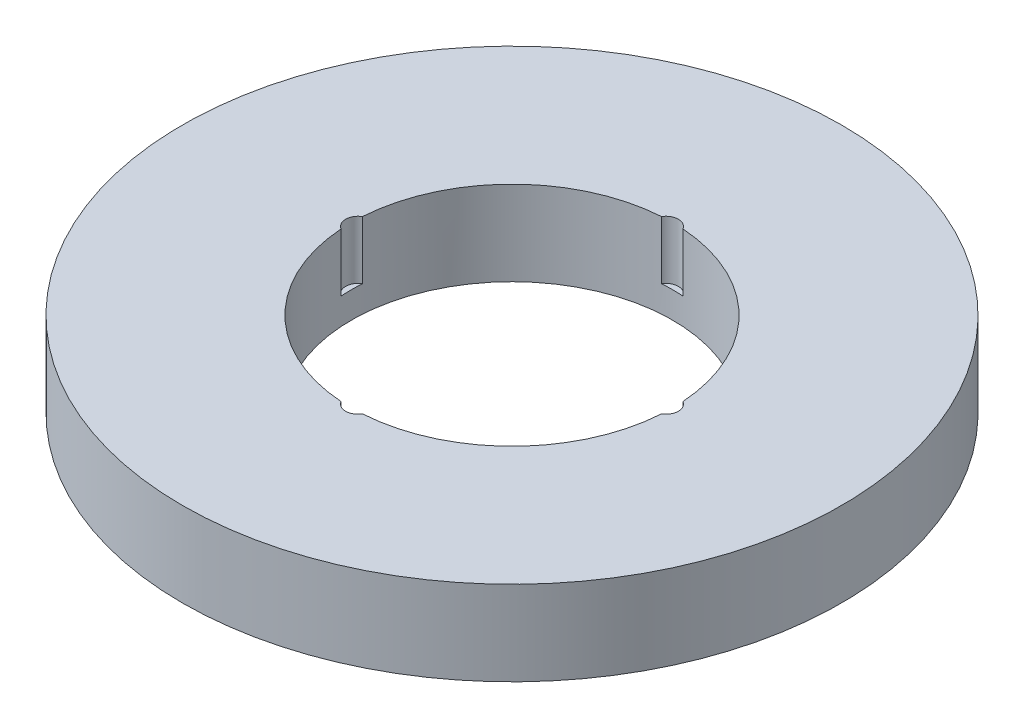
ISO-10303-21;
HEADER;
FILE_DESCRIPTION(('STEP AP214'),'2;1');
FILE_NAME('part.step','',(''),(''),'','','');
FILE_SCHEMA(('AUTOMOTIVE_DESIGN { 1 0 10303 214 1 1 1 1 }'));
ENDSEC;
DATA;
#1=APPLICATION_CONTEXT('core data for automotive mechanical design processes');
#2=APPLICATION_PROTOCOL_DEFINITION('international standard','automotive_design',2000,#1);
#3=PRODUCT_CONTEXT('',#1,'mechanical');
#4=PRODUCT('Part','Part','',(#3));
#5=PRODUCT_RELATED_PRODUCT_CATEGORY('part','',(#4));
#6=PRODUCT_DEFINITION_FORMATION('','',#4);
#7=PRODUCT_DEFINITION_CONTEXT('part definition',#1,'design');
#8=PRODUCT_DEFINITION('design','',#6,#7);
#9=PRODUCT_DEFINITION_SHAPE('','',#8);
#10=(LENGTH_UNIT() NAMED_UNIT(*) SI_UNIT(.MILLI.,.METRE.));
#11=(NAMED_UNIT(*) PLANE_ANGLE_UNIT() SI_UNIT($,.RADIAN.));
#12=(NAMED_UNIT(*) SI_UNIT($,.STERADIAN.) SOLID_ANGLE_UNIT());
#13=UNCERTAINTY_MEASURE_WITH_UNIT(LENGTH_MEASURE(1.E-05),#10,'distance_accuracy_value','');
#14=(GEOMETRIC_REPRESENTATION_CONTEXT(3) GLOBAL_UNCERTAINTY_ASSIGNED_CONTEXT((#13)) GLOBAL_UNIT_ASSIGNED_CONTEXT((#10,
#11,#12)) REPRESENTATION_CONTEXT('',''));
#15=CARTESIAN_POINT('',(0.,0.,0.));
#16=DIRECTION('',(0.,0.,1.));
#17=DIRECTION('',(1.,0.,0.));
#18=AXIS2_PLACEMENT_3D('',#15,#16,#17);
#19=CARTESIAN_POINT('',(0.,25.,0.));
#20=DIRECTION('',(0.,-1.,0.));
#21=DIRECTION('',(0.,0.,-1.));
#22=AXIS2_PLACEMENT_3D('',#19,#20,#21);
#23=CYLINDRICAL_SURFACE('',#22,97.5);
#24=CARTESIAN_POINT('',(0.,25.,0.));
#25=DIRECTION('',(0.,1.,0.));
#26=DIRECTION('',(0.,0.,1.));
#27=AXIS2_PLACEMENT_3D('',#24,#25,#26);
#28=CIRCLE('',#27,97.5);
#29=CARTESIAN_POINT('',(0.,25.,97.5));
#30=VERTEX_POINT('',#29);
#31=EDGE_CURVE('E148',#30,#30,#28,.T.);
#32=ORIENTED_EDGE('',*,*,#31,.F.);
#33=EDGE_LOOP('',(#32));
#34=FACE_BOUND('',#33,.T.);
#35=CARTESIAN_POINT('',(0.,0.,0.));
#36=DIRECTION('',(0.,1.,0.));
#37=DIRECTION('',(0.,0.,1.));
#38=AXIS2_PLACEMENT_3D('',#35,#36,#37);
#39=CIRCLE('',#38,97.5);
#40=CARTESIAN_POINT('',(0.,0.,97.5));
#41=VERTEX_POINT('',#40);
#42=EDGE_CURVE('E139',#41,#41,#39,.T.);
#43=ORIENTED_EDGE('',*,*,#42,.T.);
#44=EDGE_LOOP('',(#43));
#45=FACE_BOUND('',#44,.T.);
#46=ADVANCED_FACE('F39',(#34,#45),#23,.T.);
#47=CARTESIAN_POINT('',(0.,25.,0.));
#48=DIRECTION('',(0.,1.,0.));
#49=DIRECTION('',(0.,0.,1.));
#50=AXIS2_PLACEMENT_3D('',#47,#48,#49);
#51=PLANE('',#50);
#52=CARTESIAN_POINT('',(1.58996777581325E-13,25.,45.5384870062077));
#53=DIRECTION('',(0.,1.,0.));
#54=DIRECTION('',(1.,0.,0.));
#55=AXIS2_PLACEMENT_3D('',#52,#53,#54);
#56=CIRCLE('',#55,3.67099523526004);
#57=CARTESIAN_POINT('',(-3.16737099135007,25.,47.3942798342074));
#58=VERTEX_POINT('',#57);
#59=CARTESIAN_POINT('',(3.1673709913504,25.,47.3942798342073));
#60=VERTEX_POINT('',#59);
#61=EDGE_CURVE('E175',#58,#60,#56,.T.);
#62=ORIENTED_EDGE('',*,*,#61,.F.);
#63=CARTESIAN_POINT('',(0.,25.,0.));
#64=DIRECTION('',(0.,1.,0.));
#65=DIRECTION('',(0.,0.,1.));
#66=AXIS2_PLACEMENT_3D('',#63,#64,#65);
#67=CIRCLE('',#66,47.5);
#68=CARTESIAN_POINT('',(-47.3942798342074,25.,3.16737099135023));
#69=VERTEX_POINT('',#68);
#70=EDGE_CURVE('E134',#69,#58,#67,.T.);
#71=ORIENTED_EDGE('',*,*,#70,.F.);
#72=CARTESIAN_POINT('',(-45.5384870062077,25.,0.));
#73=DIRECTION('',(0.,1.,0.));
#74=DIRECTION('',(0.,0.,1.));
#75=AXIS2_PLACEMENT_3D('',#72,#73,#74);
#76=CIRCLE('',#75,3.67099523526004);
#77=CARTESIAN_POINT('',(-47.3942798342074,25.,-3.16737099135023));
#78=VERTEX_POINT('',#77);
#79=EDGE_CURVE('E143',#78,#69,#76,.T.);
#80=ORIENTED_EDGE('',*,*,#79,.F.);
#81=CARTESIAN_POINT('',(-3.16737099135073,25.,-47.3942798342073));
#82=VERTEX_POINT('',#81);
#83=EDGE_CURVE('E123',#82,#78,#67,.T.);
#84=ORIENTED_EDGE('',*,*,#83,.F.);
#85=CARTESIAN_POINT('',(-4.76990332743974E-13,25.,-45.5384870062077));
#86=DIRECTION('',(0.,1.,0.));
#87=DIRECTION('',(-1.,0.,0.));
#88=AXIS2_PLACEMENT_3D('',#85,#86,#87);
#89=CIRCLE('',#88,3.67099523526004);
#90=CARTESIAN_POINT('',(3.16737099134974,25.,-47.3942798342074));
#91=VERTEX_POINT('',#90);
#92=EDGE_CURVE('E106',#91,#82,#89,.T.);
#93=ORIENTED_EDGE('',*,*,#92,.F.);
#94=CARTESIAN_POINT('',(47.3942798342074,25.,-3.16737099135023));
#95=VERTEX_POINT('',#94);
#96=EDGE_CURVE('E125',#95,#91,#67,.T.);
#97=ORIENTED_EDGE('',*,*,#96,.F.);
#98=CARTESIAN_POINT('',(45.5384870062077,25.,0.));
#99=DIRECTION('',(0.,1.,0.));
#100=DIRECTION('',(0.,0.,-1.));
#101=AXIS2_PLACEMENT_3D('',#98,#99,#100);
#102=CIRCLE('',#101,3.67099523526004);
#103=CARTESIAN_POINT('',(47.3942798342074,25.,3.16737099135023));
#104=VERTEX_POINT('',#103);
#105=EDGE_CURVE('E286',#104,#95,#102,.T.);
#106=ORIENTED_EDGE('',*,*,#105,.F.);
#107=EDGE_CURVE('E135',#60,#104,#67,.T.);
#108=ORIENTED_EDGE('',*,*,#107,.F.);
#109=EDGE_LOOP('',(#62,#71,#80,#84,#93,#97,#106,#108));
#110=FACE_BOUND('',#109,.T.);
#111=ORIENTED_EDGE('',*,*,#31,.T.);
#112=EDGE_LOOP('',(#111));
#113=FACE_BOUND('',#112,.T.);
#114=ADVANCED_FACE('F118',(#110,#113),#51,.T.);
#115=CARTESIAN_POINT('',(0.,0.,0.));
#116=DIRECTION('',(0.,1.,0.));
#117=DIRECTION('',(0.,0.,1.));
#118=AXIS2_PLACEMENT_3D('',#115,#116,#117);
#119=PLANE('',#118);
#120=CARTESIAN_POINT('',(0.,0.,0.));
#121=DIRECTION('',(0.,1.,0.));
#122=DIRECTION('',(0.,0.,1.));
#123=AXIS2_PLACEMENT_3D('',#120,#121,#122);
#124=CIRCLE('',#123,47.5);
#125=CARTESIAN_POINT('',(0.,0.,47.5));
#126=VERTEX_POINT('',#125);
#127=EDGE_CURVE('E136',#126,#126,#124,.T.);
#128=ORIENTED_EDGE('',*,*,#127,.T.);
#129=EDGE_LOOP('',(#128));
#130=FACE_BOUND('',#129,.T.);
#131=ORIENTED_EDGE('',*,*,#42,.F.);
#132=EDGE_LOOP('',(#131));
#133=FACE_BOUND('',#132,.T.);
#134=ADVANCED_FACE('F187',(#130,#133),#119,.F.);
#135=CARTESIAN_POINT('',(0.,25.,0.));
#136=DIRECTION('',(0.,-1.,0.));
#137=DIRECTION('',(0.,0.,-1.));
#138=AXIS2_PLACEMENT_3D('',#135,#136,#137);
#139=CYLINDRICAL_SURFACE('',#138,47.5);
#140=DIRECTION('',(0.,1.,0.));
#141=VECTOR('',#140,1.);
#142=CARTESIAN_POINT('',(-3.16737099135008,16.3977777487847,47.3942798342073));
#143=LINE('',#142,#141);
#144=CARTESIAN_POINT('',(-3.16737099135007,7.79555549756932,47.3942798342074));
#145=VERTEX_POINT('',#144);
#146=EDGE_CURVE('E11',#145,#58,#143,.T.);
#147=ORIENTED_EDGE('',*,*,#146,.F.);
#148=CARTESIAN_POINT('',(0.,7.79555549756932,0.));
#149=DIRECTION('',(0.,1.,0.));
#150=DIRECTION('',(0.,0.,1.));
#151=AXIS2_PLACEMENT_3D('',#148,#149,#150);
#152=CIRCLE('',#151,47.5);
#153=CARTESIAN_POINT('',(3.1673709913504,7.79555549756932,47.3942798342073));
#154=VERTEX_POINT('',#153);
#155=EDGE_CURVE('E170',#145,#154,#152,.T.);
#156=ORIENTED_EDGE('',*,*,#155,.T.);
#157=DIRECTION('',(0.,1.,0.));
#158=VECTOR('',#157,1.);
#159=CARTESIAN_POINT('',(3.16737099135041,16.3977777487847,47.3942798342073));
#160=LINE('',#159,#158);
#161=EDGE_CURVE('E46',#60,#154,#160,.F.);
#162=ORIENTED_EDGE('',*,*,#161,.F.);
#163=ORIENTED_EDGE('',*,*,#107,.T.);
#164=DIRECTION('',(0.,1.,0.));
#165=VECTOR('',#164,1.);
#166=CARTESIAN_POINT('',(47.3942798342073,16.3977777487847,3.16737099135024));
#167=LINE('',#166,#165);
#168=CARTESIAN_POINT('',(47.3942798342074,7.79555549756932,3.16737099135023));
#169=VERTEX_POINT('',#168);
#170=EDGE_CURVE('E164',#169,#104,#167,.T.);
#171=ORIENTED_EDGE('',*,*,#170,.F.);
#172=CARTESIAN_POINT('',(0.,7.79555549756932,0.));
#173=DIRECTION('',(0.,1.,0.));
#174=DIRECTION('',(0.,0.,1.));
#175=AXIS2_PLACEMENT_3D('',#172,#173,#174);
#176=CIRCLE('',#175,47.5);
#177=CARTESIAN_POINT('',(47.3942798342074,7.79555549756932,-3.16737099135023));
#178=VERTEX_POINT('',#177);
#179=EDGE_CURVE('E115',#169,#178,#176,.T.);
#180=ORIENTED_EDGE('',*,*,#179,.T.);
#181=DIRECTION('',(0.,1.,0.));
#182=VECTOR('',#181,1.);
#183=CARTESIAN_POINT('',(47.3942798342073,16.3977777487847,-3.16737099135024));
#184=LINE('',#183,#182);
#185=EDGE_CURVE('E131',#95,#178,#184,.F.);
#186=ORIENTED_EDGE('',*,*,#185,.F.);
#187=ORIENTED_EDGE('',*,*,#96,.T.);
#188=DIRECTION('',(0.,1.,0.));
#189=VECTOR('',#188,1.);
#190=CARTESIAN_POINT('',(3.16737099134975,16.3977777487847,-47.3942798342074));
#191=LINE('',#190,#189);
#192=CARTESIAN_POINT('',(3.16737099134974,7.79555549756932,-47.3942798342074));
#193=VERTEX_POINT('',#192);
#194=EDGE_CURVE('E105',#193,#91,#191,.T.);
#195=ORIENTED_EDGE('',*,*,#194,.F.);
#196=CARTESIAN_POINT('',(0.,7.79555549756932,0.));
#197=DIRECTION('',(0.,1.,0.));
#198=DIRECTION('',(0.,0.,1.));
#199=AXIS2_PLACEMENT_3D('',#196,#197,#198);
#200=CIRCLE('',#199,47.5);
#201=CARTESIAN_POINT('',(-3.16737099135073,7.79555549756932,-47.3942798342073));
#202=VERTEX_POINT('',#201);
#203=EDGE_CURVE('E159',#193,#202,#200,.T.);
#204=ORIENTED_EDGE('',*,*,#203,.T.);
#205=DIRECTION('',(0.,1.,0.));
#206=VECTOR('',#205,1.);
#207=CARTESIAN_POINT('',(-3.16737099135074,16.3977777487847,-47.3942798342073));
#208=LINE('',#207,#206);
#209=EDGE_CURVE('E114',#82,#202,#208,.F.);
#210=ORIENTED_EDGE('',*,*,#209,.F.);
#211=ORIENTED_EDGE('',*,*,#83,.T.);
#212=DIRECTION('',(0.,1.,0.));
#213=VECTOR('',#212,1.);
#214=CARTESIAN_POINT('',(-47.3942798342073,16.3977777487847,-3.16737099135024));
#215=LINE('',#214,#213);
#216=CARTESIAN_POINT('',(-47.3942798342074,7.79555549756932,-3.16737099135023));
#217=VERTEX_POINT('',#216);
#218=EDGE_CURVE('E160',#217,#78,#215,.T.);
#219=ORIENTED_EDGE('',*,*,#218,.F.);
#220=CARTESIAN_POINT('',(0.,7.79555549756932,0.));
#221=DIRECTION('',(0.,1.,0.));
#222=DIRECTION('',(0.,0.,1.));
#223=AXIS2_PLACEMENT_3D('',#220,#221,#222);
#224=CIRCLE('',#223,47.5);
#225=CARTESIAN_POINT('',(-47.3942798342074,7.79555549756932,3.16737099135023));
#226=VERTEX_POINT('',#225);
#227=EDGE_CURVE('E149',#217,#226,#224,.T.);
#228=ORIENTED_EDGE('',*,*,#227,.T.);
#229=DIRECTION('',(0.,1.,0.));
#230=VECTOR('',#229,1.);
#231=CARTESIAN_POINT('',(-47.3942798342073,16.3977777487847,3.16737099135024));
#232=LINE('',#231,#230);
#233=EDGE_CURVE('E152',#69,#226,#232,.F.);
#234=ORIENTED_EDGE('',*,*,#233,.F.);
#235=ORIENTED_EDGE('',*,*,#70,.T.);
#236=EDGE_LOOP('',(#147,#156,#162,#163,#171,#180,#186,#187,#195,#204,#210,#211,#219,#228,#234,#235));
#237=FACE_BOUND('',#236,.T.);
#238=ORIENTED_EDGE('',*,*,#127,.F.);
#239=EDGE_LOOP('',(#238));
#240=FACE_BOUND('',#239,.T.);
#241=ADVANCED_FACE('F126',(#237,#240),#139,.F.);
#242=CARTESIAN_POINT('',(-45.5384870062077,7.79555549756932,0.));
#243=DIRECTION('',(0.,1.,0.));
#244=DIRECTION('',(0.,0.,1.));
#245=AXIS2_PLACEMENT_3D('',#242,#243,#244);
#246=CYLINDRICAL_SURFACE('',#245,3.67099523526004);
#247=ORIENTED_EDGE('',*,*,#218,.T.);
#248=ORIENTED_EDGE('',*,*,#79,.T.);
#249=ORIENTED_EDGE('',*,*,#233,.T.);
#250=CARTESIAN_POINT('',(-45.5384870062077,7.79555549756932,0.));
#251=DIRECTION('',(0.,1.,0.));
#252=DIRECTION('',(0.,0.,1.));
#253=AXIS2_PLACEMENT_3D('',#250,#251,#252);
#254=CIRCLE('',#253,3.67099523526004);
#255=EDGE_CURVE('E144',#217,#226,#254,.T.);
#256=ORIENTED_EDGE('',*,*,#255,.F.);
#257=EDGE_LOOP('',(#247,#248,#249,#256));
#258=FACE_BOUND('',#257,.T.);
#259=ADVANCED_FACE('F200',(#258),#246,.F.);
#260=CARTESIAN_POINT('',(-45.5384870062077,7.79555549756932,0.));
#261=DIRECTION('',(0.,1.,0.));
#262=DIRECTION('',(0.,0.,1.));
#263=AXIS2_PLACEMENT_3D('',#260,#261,#262);
#264=PLANE('',#263);
#265=ORIENTED_EDGE('',*,*,#255,.T.);
#266=ORIENTED_EDGE('',*,*,#227,.F.);
#267=EDGE_LOOP('',(#265,#266));
#268=FACE_BOUND('',#267,.T.);
#269=ADVANCED_FACE('F201',(#268),#264,.T.);
#270=CARTESIAN_POINT('',(-4.76990332743974E-13,7.79555549756932,-45.5384870062077));
#271=DIRECTION('',(0.,1.,0.));
#272=DIRECTION('',(0.,0.,1.));
#273=AXIS2_PLACEMENT_3D('',#270,#271,#272);
#274=CYLINDRICAL_SURFACE('',#273,3.67099523526004);
#275=ORIENTED_EDGE('',*,*,#194,.T.);
#276=ORIENTED_EDGE('',*,*,#92,.T.);
#277=ORIENTED_EDGE('',*,*,#209,.T.);
#278=CARTESIAN_POINT('',(-4.76990332743974E-13,7.79555549756932,-45.5384870062077));
#279=DIRECTION('',(0.,1.,0.));
#280=DIRECTION('',(-1.,0.,0.));
#281=AXIS2_PLACEMENT_3D('',#278,#279,#280);
#282=CIRCLE('',#281,3.67099523526004);
#283=EDGE_CURVE('E107',#193,#202,#282,.T.);
#284=ORIENTED_EDGE('',*,*,#283,.F.);
#285=EDGE_LOOP('',(#275,#276,#277,#284));
#286=FACE_BOUND('',#285,.T.);
#287=ADVANCED_FACE('F102',(#286),#274,.F.);
#288=CARTESIAN_POINT('',(-4.76990332743974E-13,7.79555549756932,-45.5384870062077));
#289=DIRECTION('',(0.,1.,0.));
#290=DIRECTION('',(-1.,0.,0.));
#291=AXIS2_PLACEMENT_3D('',#288,#289,#290);
#292=PLANE('',#291);
#293=ORIENTED_EDGE('',*,*,#283,.T.);
#294=ORIENTED_EDGE('',*,*,#203,.F.);
#295=EDGE_LOOP('',(#293,#294));
#296=FACE_BOUND('',#295,.T.);
#297=ADVANCED_FACE('F209',(#296),#292,.T.);
#298=CARTESIAN_POINT('',(45.5384870062077,7.79555549756932,0.));
#299=DIRECTION('',(0.,1.,0.));
#300=DIRECTION('',(0.,0.,1.));
#301=AXIS2_PLACEMENT_3D('',#298,#299,#300);
#302=CYLINDRICAL_SURFACE('',#301,3.67099523526004);
#303=ORIENTED_EDGE('',*,*,#170,.T.);
#304=ORIENTED_EDGE('',*,*,#105,.T.);
#305=ORIENTED_EDGE('',*,*,#185,.T.);
#306=CARTESIAN_POINT('',(45.5384870062077,7.79555549756932,0.));
#307=DIRECTION('',(0.,1.,0.));
#308=DIRECTION('',(0.,0.,-1.));
#309=AXIS2_PLACEMENT_3D('',#306,#307,#308);
#310=CIRCLE('',#309,3.67099523526004);
#311=EDGE_CURVE('E56',#169,#178,#310,.T.);
#312=ORIENTED_EDGE('',*,*,#311,.F.);
#313=EDGE_LOOP('',(#303,#304,#305,#312));
#314=FACE_BOUND('',#313,.T.);
#315=ADVANCED_FACE('F213',(#314),#302,.F.);
#316=CARTESIAN_POINT('',(45.5384870062077,7.79555549756932,0.));
#317=DIRECTION('',(0.,1.,0.));
#318=DIRECTION('',(0.,0.,-1.));
#319=AXIS2_PLACEMENT_3D('',#316,#317,#318);
#320=PLANE('',#319);
#321=ORIENTED_EDGE('',*,*,#311,.T.);
#322=ORIENTED_EDGE('',*,*,#179,.F.);
#323=EDGE_LOOP('',(#321,#322));
#324=FACE_BOUND('',#323,.T.);
#325=ADVANCED_FACE('F179',(#324),#320,.T.);
#326=CARTESIAN_POINT('',(1.58996777581325E-13,7.79555549756932,45.5384870062077));
#327=DIRECTION('',(0.,1.,0.));
#328=DIRECTION('',(0.,0.,1.));
#329=AXIS2_PLACEMENT_3D('',#326,#327,#328);
#330=CYLINDRICAL_SURFACE('',#329,3.67099523526004);
#331=ORIENTED_EDGE('',*,*,#146,.T.);
#332=ORIENTED_EDGE('',*,*,#61,.T.);
#333=ORIENTED_EDGE('',*,*,#161,.T.);
#334=CARTESIAN_POINT('',(1.58996777581325E-13,7.79555549756932,45.5384870062077));
#335=DIRECTION('',(0.,1.,0.));
#336=DIRECTION('',(1.,0.,0.));
#337=AXIS2_PLACEMENT_3D('',#334,#335,#336);
#338=CIRCLE('',#337,3.67099523526004);
#339=EDGE_CURVE('E55',#145,#154,#338,.T.);
#340=ORIENTED_EDGE('',*,*,#339,.F.);
#341=EDGE_LOOP('',(#331,#332,#333,#340));
#342=FACE_BOUND('',#341,.T.);
#343=ADVANCED_FACE('F171',(#342),#330,.F.);
#344=CARTESIAN_POINT('',(1.58996777581325E-13,7.79555549756932,45.5384870062077));
#345=DIRECTION('',(0.,1.,0.));
#346=DIRECTION('',(1.,0.,0.));
#347=AXIS2_PLACEMENT_3D('',#344,#345,#346);
#348=PLANE('',#347);
#349=ORIENTED_EDGE('',*,*,#339,.T.);
#350=ORIENTED_EDGE('',*,*,#155,.F.);
#351=EDGE_LOOP('',(#349,#350));
#352=FACE_BOUND('',#351,.T.);
#353=ADVANCED_FACE('F173',(#352),#348,.T.);
#354=CLOSED_SHELL('',(#46,#114,#134,#241,#259,#269,#287,#297,#315,#325,#343,#353));
#355=MANIFOLD_SOLID_BREP('B2',#354);
#356=ADVANCED_BREP_SHAPE_REPRESENTATION('',(#18,#355),#14);
#357=SHAPE_DEFINITION_REPRESENTATION(#9,#356);
ENDSEC;
END-ISO-10303-21;
